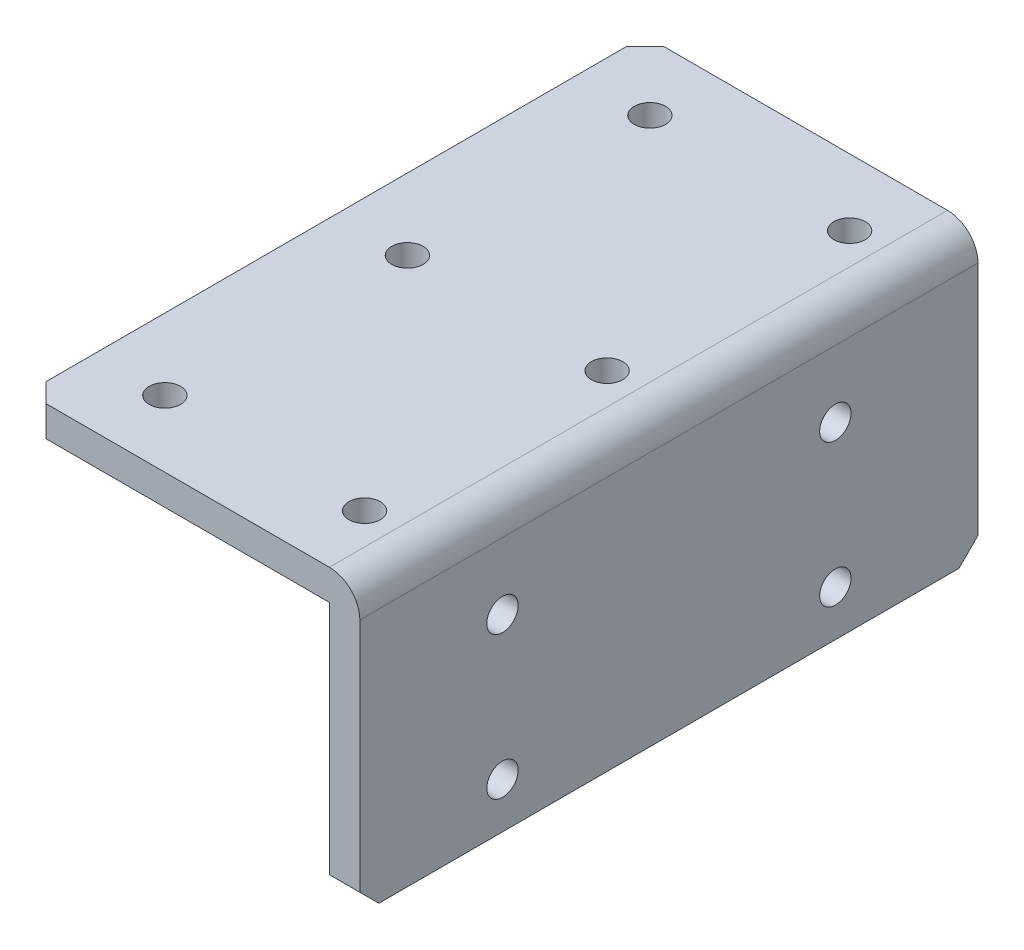
ISO-10303-21;
HEADER;
FILE_DESCRIPTION(('STEP AP214'),'2;1');
FILE_NAME('part.step','',(''),(''),'','','');
FILE_SCHEMA(('AUTOMOTIVE_DESIGN { 1 0 10303 214 1 1 1 1 }'));
ENDSEC;
DATA;
#1=APPLICATION_CONTEXT('core data for automotive mechanical design processes');
#2=APPLICATION_PROTOCOL_DEFINITION('international standard','automotive_design',2000,#1);
#3=PRODUCT_CONTEXT('',#1,'mechanical');
#4=PRODUCT('Part','Part','',(#3));
#5=PRODUCT_RELATED_PRODUCT_CATEGORY('part','',(#4));
#6=PRODUCT_DEFINITION_FORMATION('','',#4);
#7=PRODUCT_DEFINITION_CONTEXT('part definition',#1,'design');
#8=PRODUCT_DEFINITION('design','',#6,#7);
#9=PRODUCT_DEFINITION_SHAPE('','',#8);
#10=(LENGTH_UNIT() NAMED_UNIT(*) SI_UNIT(.MILLI.,.METRE.));
#11=(NAMED_UNIT(*) PLANE_ANGLE_UNIT() SI_UNIT($,.RADIAN.));
#12=(NAMED_UNIT(*) SI_UNIT($,.STERADIAN.) SOLID_ANGLE_UNIT());
#13=UNCERTAINTY_MEASURE_WITH_UNIT(LENGTH_MEASURE(1.E-05),#10,'distance_accuracy_value','');
#14=(GEOMETRIC_REPRESENTATION_CONTEXT(3) GLOBAL_UNCERTAINTY_ASSIGNED_CONTEXT((#13)) GLOBAL_UNIT_ASSIGNED_CONTEXT((#10,
#11,#12)) REPRESENTATION_CONTEXT('',''));
#15=CARTESIAN_POINT('',(0.,0.,0.));
#16=DIRECTION('',(0.,0.,1.));
#17=DIRECTION('',(1.,0.,0.));
#18=AXIS2_PLACEMENT_3D('',#15,#16,#17);
#19=CARTESIAN_POINT('',(0.,-30.,-32.5));
#20=DIRECTION('',(1.,0.,0.));
#21=DIRECTION('',(0.,0.,-1.));
#22=AXIS2_PLACEMENT_3D('',#19,#20,#21);
#23=PLANE('',#22);
#24=CARTESIAN_POINT('',(0.,-10.2,17.5));
#25=DIRECTION('',(1.,0.,0.));
#26=DIRECTION('',(0.,0.,-1.));
#27=AXIS2_PLACEMENT_3D('',#24,#25,#26);
#28=CIRCLE('',#27,1.64999999999999);
#29=CARTESIAN_POINT('',(0.,-10.2,15.85));
#30=VERTEX_POINT('',#29);
#31=EDGE_CURVE('E264',#30,#30,#28,.T.);
#32=ORIENTED_EDGE('',*,*,#31,.F.);
#33=EDGE_LOOP('',(#32));
#34=FACE_BOUND('',#33,.T.);
#35=CARTESIAN_POINT('',(0.,-25.2,17.5));
#36=DIRECTION('',(1.,0.,0.));
#37=DIRECTION('',(0.,0.,-1.));
#38=AXIS2_PLACEMENT_3D('',#35,#36,#37);
#39=CIRCLE('',#38,1.64999999999999);
#40=CARTESIAN_POINT('',(0.,-25.2,15.85));
#41=VERTEX_POINT('',#40);
#42=EDGE_CURVE('E258',#41,#41,#39,.T.);
#43=ORIENTED_EDGE('',*,*,#42,.F.);
#44=EDGE_LOOP('',(#43));
#45=FACE_BOUND('',#44,.T.);
#46=CARTESIAN_POINT('',(0.,-25.2,-17.5));
#47=DIRECTION('',(1.,0.,0.));
#48=DIRECTION('',(0.,0.,-1.));
#49=AXIS2_PLACEMENT_3D('',#46,#47,#48);
#50=CIRCLE('',#49,1.64999999999999);
#51=CARTESIAN_POINT('',(0.,-25.2,-19.15));
#52=VERTEX_POINT('',#51);
#53=EDGE_CURVE('E252',#52,#52,#50,.T.);
#54=ORIENTED_EDGE('',*,*,#53,.F.);
#55=EDGE_LOOP('',(#54));
#56=FACE_BOUND('',#55,.T.);
#57=CARTESIAN_POINT('',(0.,-10.2,-17.5));
#58=DIRECTION('',(1.,0.,0.));
#59=DIRECTION('',(0.,0.,-1.));
#60=AXIS2_PLACEMENT_3D('',#57,#58,#59);
#61=CIRCLE('',#60,1.64999999999999);
#62=CARTESIAN_POINT('',(0.,-10.2,-19.15));
#63=VERTEX_POINT('',#62);
#64=EDGE_CURVE('E244',#63,#63,#61,.T.);
#65=ORIENTED_EDGE('',*,*,#64,.F.);
#66=EDGE_LOOP('',(#65));
#67=FACE_BOUND('',#66,.T.);
#68=DIRECTION('',(0.,0.,1.));
#69=VECTOR('',#68,1.);
#70=CARTESIAN_POINT('',(0.,-30.,-32.5));
#71=LINE('',#70,#69);
#72=CARTESIAN_POINT('',(0.,-30.,-30.5));
#73=VERTEX_POINT('',#72);
#74=CARTESIAN_POINT('',(0.,-30.,30.5));
#75=VERTEX_POINT('',#74);
#76=EDGE_CURVE('E156',#73,#75,#71,.T.);
#77=ORIENTED_EDGE('',*,*,#76,.F.);
#78=DIRECTION('',(0.,0.707106781186549,-0.707106781186546));
#79=VECTOR('',#78,1.);
#80=CARTESIAN_POINT('',(0.,-29.,-31.5));
#81=LINE('',#80,#79);
#82=CARTESIAN_POINT('',(0.,-28.,-32.5));
#83=VERTEX_POINT('',#82);
#84=EDGE_CURVE('E223',#73,#83,#81,.T.);
#85=ORIENTED_EDGE('',*,*,#84,.T.);
#86=DIRECTION('',(0.,1.,0.));
#87=VECTOR('',#86,1.);
#88=CARTESIAN_POINT('',(0.,-30.,-32.5));
#89=LINE('',#88,#87);
#90=CARTESIAN_POINT('',(0.,-3.2,-32.5));
#91=VERTEX_POINT('',#90);
#92=EDGE_CURVE('E144',#83,#91,#89,.T.);
#93=ORIENTED_EDGE('',*,*,#92,.T.);
#94=DIRECTION('',(0.,0.,1.));
#95=VECTOR('',#94,1.);
#96=CARTESIAN_POINT('',(0.,-3.2,-32.5));
#97=LINE('',#96,#95);
#98=CARTESIAN_POINT('',(0.,-3.2,32.5));
#99=VERTEX_POINT('',#98);
#100=EDGE_CURVE('E158',#91,#99,#97,.T.);
#101=ORIENTED_EDGE('',*,*,#100,.T.);
#102=DIRECTION('',(0.,1.,0.));
#103=VECTOR('',#102,1.);
#104=CARTESIAN_POINT('',(0.,-30.,32.5));
#105=LINE('',#104,#103);
#106=CARTESIAN_POINT('',(0.,-28.,32.5));
#107=VERTEX_POINT('',#106);
#108=EDGE_CURVE('E239',#107,#99,#105,.T.);
#109=ORIENTED_EDGE('',*,*,#108,.F.);
#110=DIRECTION('',(0.,0.707106781186546,0.707106781186549));
#111=VECTOR('',#110,1.);
#112=CARTESIAN_POINT('',(0.,-61.5,-1.00000000000012));
#113=LINE('',#112,#111);
#114=EDGE_CURVE('E221',#107,#75,#113,.F.);
#115=ORIENTED_EDGE('',*,*,#114,.T.);
#116=EDGE_LOOP('',(#77,#85,#93,#101,#109,#115));
#117=FACE_BOUND('',#116,.T.);
#118=ADVANCED_FACE('F34',(#34,#45,#56,#67,#117),#23,.T.);
#119=CARTESIAN_POINT('',(0.,-30.,-32.5));
#120=DIRECTION('',(0.,-1.,0.));
#121=DIRECTION('',(0.,0.,-1.));
#122=AXIS2_PLACEMENT_3D('',#119,#120,#121);
#123=PLANE('',#122);
#124=DIRECTION('',(0.,0.,1.));
#125=VECTOR('',#124,1.);
#126=CARTESIAN_POINT('',(-3.2,-30.,-32.5));
#127=LINE('',#126,#125);
#128=CARTESIAN_POINT('',(-3.2,-30.,-30.5));
#129=VERTEX_POINT('',#128);
#130=CARTESIAN_POINT('',(-3.2,-30.,30.5));
#131=VERTEX_POINT('',#130);
#132=EDGE_CURVE('E139',#129,#131,#127,.T.);
#133=ORIENTED_EDGE('',*,*,#132,.F.);
#134=DIRECTION('',(1.,0.,0.));
#135=VECTOR('',#134,1.);
#136=CARTESIAN_POINT('',(0.,-30.,-30.5));
#137=LINE('',#136,#135);
#138=EDGE_CURVE('E218',#129,#73,#137,.T.);
#139=ORIENTED_EDGE('',*,*,#138,.T.);
#140=ORIENTED_EDGE('',*,*,#76,.T.);
#141=DIRECTION('',(-1.,0.,0.));
#142=VECTOR('',#141,1.);
#143=CARTESIAN_POINT('',(0.,-30.,30.5));
#144=LINE('',#143,#142);
#145=EDGE_CURVE('E49',#75,#131,#144,.T.);
#146=ORIENTED_EDGE('',*,*,#145,.T.);
#147=EDGE_LOOP('',(#133,#139,#140,#146));
#148=FACE_BOUND('',#147,.T.);
#149=ADVANCED_FACE('F236',(#148),#123,.T.);
#150=CARTESIAN_POINT('',(-3.2,-30.,-32.5));
#151=DIRECTION('',(-1.,0.,0.));
#152=DIRECTION('',(0.,0.,1.));
#153=AXIS2_PLACEMENT_3D('',#150,#151,#152);
#154=PLANE('',#153);
#155=CARTESIAN_POINT('',(-3.2,-10.2,17.5));
#156=DIRECTION('',(-1.,0.,0.));
#157=DIRECTION('',(0.,0.,1.));
#158=AXIS2_PLACEMENT_3D('',#155,#156,#157);
#159=CIRCLE('',#158,1.64999999999999);
#160=CARTESIAN_POINT('',(-3.2,-10.2,19.15));
#161=VERTEX_POINT('',#160);
#162=EDGE_CURVE('E261',#161,#161,#159,.T.);
#163=ORIENTED_EDGE('',*,*,#162,.F.);
#164=EDGE_LOOP('',(#163));
#165=FACE_BOUND('',#164,.T.);
#166=CARTESIAN_POINT('',(-3.2,-25.2,17.5));
#167=DIRECTION('',(-1.,0.,0.));
#168=DIRECTION('',(0.,0.,1.));
#169=AXIS2_PLACEMENT_3D('',#166,#167,#168);
#170=CIRCLE('',#169,1.64999999999999);
#171=CARTESIAN_POINT('',(-3.2,-25.2,19.15));
#172=VERTEX_POINT('',#171);
#173=EDGE_CURVE('E255',#172,#172,#170,.T.);
#174=ORIENTED_EDGE('',*,*,#173,.F.);
#175=EDGE_LOOP('',(#174));
#176=FACE_BOUND('',#175,.T.);
#177=CARTESIAN_POINT('',(-3.2,-25.2,-17.5));
#178=DIRECTION('',(-1.,0.,0.));
#179=DIRECTION('',(0.,0.,1.));
#180=AXIS2_PLACEMENT_3D('',#177,#178,#179);
#181=CIRCLE('',#180,1.64999999999999);
#182=CARTESIAN_POINT('',(-3.2,-25.2,-15.85));
#183=VERTEX_POINT('',#182);
#184=EDGE_CURVE('E249',#183,#183,#181,.T.);
#185=ORIENTED_EDGE('',*,*,#184,.F.);
#186=EDGE_LOOP('',(#185));
#187=FACE_BOUND('',#186,.T.);
#188=CARTESIAN_POINT('',(-3.2,-10.2,-17.5));
#189=DIRECTION('',(-1.,0.,0.));
#190=DIRECTION('',(0.,0.,1.));
#191=AXIS2_PLACEMENT_3D('',#188,#189,#190);
#192=CIRCLE('',#191,1.64999999999999);
#193=CARTESIAN_POINT('',(-3.2,-10.2,-15.85));
#194=VERTEX_POINT('',#193);
#195=EDGE_CURVE('E241',#194,#194,#192,.T.);
#196=ORIENTED_EDGE('',*,*,#195,.F.);
#197=EDGE_LOOP('',(#196));
#198=FACE_BOUND('',#197,.T.);
#199=DIRECTION('',(0.,-1.,0.));
#200=VECTOR('',#199,1.);
#201=CARTESIAN_POINT('',(-3.2,-30.,-32.5));
#202=LINE('',#201,#200);
#203=CARTESIAN_POINT('',(-3.2,-3.2,-32.5));
#204=VERTEX_POINT('',#203);
#205=CARTESIAN_POINT('',(-3.2,-28.,-32.5));
#206=VERTEX_POINT('',#205);
#207=EDGE_CURVE('E153',#204,#206,#202,.T.);
#208=ORIENTED_EDGE('',*,*,#207,.T.);
#209=DIRECTION('',(0.,-0.707106781186549,0.707106781186546));
#210=VECTOR('',#209,1.);
#211=CARTESIAN_POINT('',(-3.2,-29.,-31.5));
#212=LINE('',#211,#210);
#213=EDGE_CURVE('E11',#206,#129,#212,.T.);
#214=ORIENTED_EDGE('',*,*,#213,.T.);
#215=ORIENTED_EDGE('',*,*,#132,.T.);
#216=DIRECTION('',(0.,-0.707106781186546,-0.707106781186549));
#217=VECTOR('',#216,1.);
#218=CARTESIAN_POINT('',(-3.2,-61.5,-1.00000000000012));
#219=LINE('',#218,#217);
#220=CARTESIAN_POINT('',(-3.2,-28.,32.5));
#221=VERTEX_POINT('',#220);
#222=EDGE_CURVE('E42',#131,#221,#219,.F.);
#223=ORIENTED_EDGE('',*,*,#222,.T.);
#224=DIRECTION('',(0.,-1.,0.));
#225=VECTOR('',#224,1.);
#226=CARTESIAN_POINT('',(-3.2,-30.,32.5));
#227=LINE('',#226,#225);
#228=CARTESIAN_POINT('',(-3.2,-3.2,32.5));
#229=VERTEX_POINT('',#228);
#230=EDGE_CURVE('E124',#229,#221,#227,.T.);
#231=ORIENTED_EDGE('',*,*,#230,.F.);
#232=DIRECTION('',(0.,0.,1.));
#233=VECTOR('',#232,1.);
#234=CARTESIAN_POINT('',(-3.2,-3.2,-32.5));
#235=LINE('',#234,#233);
#236=EDGE_CURVE('E132',#204,#229,#235,.T.);
#237=ORIENTED_EDGE('',*,*,#236,.F.);
#238=EDGE_LOOP('',(#208,#214,#215,#223,#231,#237));
#239=FACE_BOUND('',#238,.T.);
#240=ADVANCED_FACE('F142',(#165,#176,#187,#198,#239),#154,.T.);
#241=CARTESIAN_POINT('',(-3.2,-3.2,-32.5));
#242=DIRECTION('',(0.,-1.,0.));
#243=DIRECTION('',(1.,0.,0.));
#244=AXIS2_PLACEMENT_3D('',#241,#242,#243);
#245=PLANE('',#244);
#246=CARTESIAN_POINT('',(-27.5,-3.2,25.5));
#247=DIRECTION('',(0.,-1.,0.));
#248=DIRECTION('',(1.,0.,0.));
#249=AXIS2_PLACEMENT_3D('',#246,#247,#248);
#250=CIRCLE('',#249,1.64999999999999);
#251=CARTESIAN_POINT('',(-25.85,-3.2,25.5));
#252=VERTEX_POINT('',#251);
#253=EDGE_CURVE('E273',#252,#252,#250,.T.);
#254=ORIENTED_EDGE('',*,*,#253,.F.);
#255=EDGE_LOOP('',(#254));
#256=FACE_BOUND('',#255,.T.);
#257=CARTESIAN_POINT('',(-6.5,-3.2,25.5));
#258=DIRECTION('',(0.,-1.,0.));
#259=DIRECTION('',(1.,0.,0.));
#260=AXIS2_PLACEMENT_3D('',#257,#258,#259);
#261=CIRCLE('',#260,1.64999999999999);
#262=CARTESIAN_POINT('',(-4.85,-3.2,25.5));
#263=VERTEX_POINT('',#262);
#264=EDGE_CURVE('E267',#263,#263,#261,.T.);
#265=ORIENTED_EDGE('',*,*,#264,.F.);
#266=EDGE_LOOP('',(#265));
#267=FACE_BOUND('',#266,.T.);
#268=DIRECTION('',(0.,0.,1.));
#269=VECTOR('',#268,1.);
#270=CARTESIAN_POINT('',(-35.,-3.20000000000001,-32.5));
#271=LINE('',#270,#269);
#272=CARTESIAN_POINT('',(-35.,-3.20000000000001,-30.5));
#273=VERTEX_POINT('',#272);
#274=CARTESIAN_POINT('',(-35.,-3.20000000000001,30.5));
#275=VERTEX_POINT('',#274);
#276=EDGE_CURVE('E140',#273,#275,#271,.T.);
#277=ORIENTED_EDGE('',*,*,#276,.F.);
#278=DIRECTION('',(0.707106781186549,0.,-0.707106781186546));
#279=VECTOR('',#278,1.);
#280=CARTESIAN_POINT('',(-18.0999999999999,-3.2,-47.4));
#281=LINE('',#280,#279);
#282=CARTESIAN_POINT('',(-33.,-3.2,-32.5));
#283=VERTEX_POINT('',#282);
#284=EDGE_CURVE('E204',#273,#283,#281,.T.);
#285=ORIENTED_EDGE('',*,*,#284,.T.);
#286=DIRECTION('',(1.,0.,0.));
#287=VECTOR('',#286,1.);
#288=CARTESIAN_POINT('',(-3.2,-3.2,-32.5));
#289=LINE('',#288,#287);
#290=EDGE_CURVE('E137',#283,#204,#289,.T.);
#291=ORIENTED_EDGE('',*,*,#290,.T.);
#292=ORIENTED_EDGE('',*,*,#236,.T.);
#293=DIRECTION('',(1.,0.,0.));
#294=VECTOR('',#293,1.);
#295=CARTESIAN_POINT('',(-3.2,-3.2,32.5));
#296=LINE('',#295,#294);
#297=CARTESIAN_POINT('',(-33.,-3.20000000000001,32.5));
#298=VERTEX_POINT('',#297);
#299=EDGE_CURVE('E118',#298,#229,#296,.T.);
#300=ORIENTED_EDGE('',*,*,#299,.F.);
#301=DIRECTION('',(0.707106781186546,0.,0.707106781186549));
#302=VECTOR('',#301,1.);
#303=CARTESIAN_POINT('',(-50.6000000000001,-3.20000000000001,14.8999999999999));
#304=LINE('',#303,#302);
#305=EDGE_CURVE('E202',#298,#275,#304,.F.);
#306=ORIENTED_EDGE('',*,*,#305,.T.);
#307=EDGE_LOOP('',(#277,#285,#291,#292,#300,#306));
#308=FACE_BOUND('',#307,.T.);
#309=CARTESIAN_POINT('',(-6.5,-3.2,0.));
#310=DIRECTION('',(0.,-1.,0.));
#311=DIRECTION('',(1.,0.,0.));
#312=AXIS2_PLACEMENT_3D('',#309,#310,#311);
#313=CIRCLE('',#312,1.64999999999999);
#314=CARTESIAN_POINT('',(-4.85,-3.2,0.));
#315=VERTEX_POINT('',#314);
#316=EDGE_CURVE('E176',#315,#315,#313,.T.);
#317=ORIENTED_EDGE('',*,*,#316,.F.);
#318=EDGE_LOOP('',(#317));
#319=FACE_BOUND('',#318,.T.);
#320=CARTESIAN_POINT('',(-27.5,-3.2,0.));
#321=DIRECTION('',(0.,-1.,0.));
#322=DIRECTION('',(1.,0.,0.));
#323=AXIS2_PLACEMENT_3D('',#320,#321,#322);
#324=CIRCLE('',#323,1.64999999999999);
#325=CARTESIAN_POINT('',(-25.85,-3.2,0.));
#326=VERTEX_POINT('',#325);
#327=EDGE_CURVE('E182',#326,#326,#324,.T.);
#328=ORIENTED_EDGE('',*,*,#327,.F.);
#329=EDGE_LOOP('',(#328));
#330=FACE_BOUND('',#329,.T.);
#331=CARTESIAN_POINT('',(-6.5,-3.2,-25.5));
#332=DIRECTION('',(0.,-1.,0.));
#333=DIRECTION('',(1.,0.,0.));
#334=AXIS2_PLACEMENT_3D('',#331,#332,#333);
#335=CIRCLE('',#334,1.64999999999999);
#336=CARTESIAN_POINT('',(-4.85,-3.2,-25.5));
#337=VERTEX_POINT('',#336);
#338=EDGE_CURVE('E188',#337,#337,#335,.T.);
#339=ORIENTED_EDGE('',*,*,#338,.F.);
#340=EDGE_LOOP('',(#339));
#341=FACE_BOUND('',#340,.T.);
#342=CARTESIAN_POINT('',(-27.5,-3.2,-25.5));
#343=DIRECTION('',(0.,-1.,0.));
#344=DIRECTION('',(1.,0.,0.));
#345=AXIS2_PLACEMENT_3D('',#342,#343,#344);
#346=CIRCLE('',#345,1.64999999999999);
#347=CARTESIAN_POINT('',(-25.85,-3.2,-25.5));
#348=VERTEX_POINT('',#347);
#349=EDGE_CURVE('E194',#348,#348,#346,.T.);
#350=ORIENTED_EDGE('',*,*,#349,.F.);
#351=EDGE_LOOP('',(#350));
#352=FACE_BOUND('',#351,.T.);
#353=ADVANCED_FACE('F134',(#256,#267,#308,#319,#330,#341,#352),#245,.T.);
#354=CARTESIAN_POINT('',(-35.,0.,-32.5));
#355=DIRECTION('',(-1.,0.,0.));
#356=DIRECTION('',(0.,0.,1.));
#357=AXIS2_PLACEMENT_3D('',#354,#355,#356);
#358=PLANE('',#357);
#359=DIRECTION('',(0.,0.,1.));
#360=VECTOR('',#359,1.);
#361=CARTESIAN_POINT('',(-35.,0.,-32.5));
#362=LINE('',#361,#360);
#363=CARTESIAN_POINT('',(-35.,0.,-30.5));
#364=VERTEX_POINT('',#363);
#365=CARTESIAN_POINT('',(-35.,0.,30.5));
#366=VERTEX_POINT('',#365);
#367=EDGE_CURVE('E155',#364,#366,#362,.T.);
#368=ORIENTED_EDGE('',*,*,#367,.F.);
#369=DIRECTION('',(0.,-1.,0.));
#370=VECTOR('',#369,1.);
#371=CARTESIAN_POINT('',(-35.,-3.20000000000001,-30.5));
#372=LINE('',#371,#370);
#373=EDGE_CURVE('E199',#364,#273,#372,.T.);
#374=ORIENTED_EDGE('',*,*,#373,.T.);
#375=ORIENTED_EDGE('',*,*,#276,.T.);
#376=DIRECTION('',(0.,1.,0.));
#377=VECTOR('',#376,1.);
#378=CARTESIAN_POINT('',(-35.,0.,30.5));
#379=LINE('',#378,#377);
#380=EDGE_CURVE('E197',#275,#366,#379,.T.);
#381=ORIENTED_EDGE('',*,*,#380,.T.);
#382=EDGE_LOOP('',(#368,#374,#375,#381));
#383=FACE_BOUND('',#382,.T.);
#384=ADVANCED_FACE('F286',(#383),#358,.T.);
#385=CARTESIAN_POINT('',(0.,0.,-32.5));
#386=DIRECTION('',(0.,1.,0.));
#387=DIRECTION('',(-1.,0.,0.));
#388=AXIS2_PLACEMENT_3D('',#385,#386,#387);
#389=PLANE('',#388);
#390=CARTESIAN_POINT('',(-27.5,0.,25.5));
#391=DIRECTION('',(0.,1.,0.));
#392=DIRECTION('',(0.,0.,1.));
#393=AXIS2_PLACEMENT_3D('',#390,#391,#392);
#394=CIRCLE('',#393,1.64999999999999);
#395=CARTESIAN_POINT('',(-27.5,0.,27.15));
#396=VERTEX_POINT('',#395);
#397=EDGE_CURVE('E276',#396,#396,#394,.T.);
#398=ORIENTED_EDGE('',*,*,#397,.F.);
#399=EDGE_LOOP('',(#398));
#400=FACE_BOUND('',#399,.T.);
#401=CARTESIAN_POINT('',(-6.5,0.,25.5));
#402=DIRECTION('',(0.,1.,0.));
#403=DIRECTION('',(0.,0.,1.));
#404=AXIS2_PLACEMENT_3D('',#401,#402,#403);
#405=CIRCLE('',#404,1.64999999999999);
#406=CARTESIAN_POINT('',(-6.5,0.,27.15));
#407=VERTEX_POINT('',#406);
#408=EDGE_CURVE('E270',#407,#407,#405,.T.);
#409=ORIENTED_EDGE('',*,*,#408,.F.);
#410=EDGE_LOOP('',(#409));
#411=FACE_BOUND('',#410,.T.);
#412=DIRECTION('',(-1.,0.,0.));
#413=VECTOR('',#412,1.);
#414=CARTESIAN_POINT('',(0.,0.,-32.5));
#415=LINE('',#414,#413);
#416=CARTESIAN_POINT('',(-3.2,0.,-32.5));
#417=VERTEX_POINT('',#416);
#418=CARTESIAN_POINT('',(-33.,0.,-32.5));
#419=VERTEX_POINT('',#418);
#420=EDGE_CURVE('E146',#417,#419,#415,.T.);
#421=ORIENTED_EDGE('',*,*,#420,.T.);
#422=DIRECTION('',(-0.707106781186549,0.,0.707106781186546));
#423=VECTOR('',#422,1.);
#424=CARTESIAN_POINT('',(-16.4999999999999,0.,-49.));
#425=LINE('',#424,#423);
#426=EDGE_CURVE('E212',#419,#364,#425,.T.);
#427=ORIENTED_EDGE('',*,*,#426,.T.);
#428=ORIENTED_EDGE('',*,*,#367,.T.);
#429=DIRECTION('',(-0.707106781186546,0.,-0.707106781186549));
#430=VECTOR('',#429,1.);
#431=CARTESIAN_POINT('',(-49.0000000000001,0.,16.4999999999999));
#432=LINE('',#431,#430);
#433=CARTESIAN_POINT('',(-33.,0.,32.5));
#434=VERTEX_POINT('',#433);
#435=EDGE_CURVE('E210',#366,#434,#432,.F.);
#436=ORIENTED_EDGE('',*,*,#435,.T.);
#437=DIRECTION('',(-1.,0.,0.));
#438=VECTOR('',#437,1.);
#439=CARTESIAN_POINT('',(0.,0.,32.5));
#440=LINE('',#439,#438);
#441=CARTESIAN_POINT('',(-3.2,0.,32.5));
#442=VERTEX_POINT('',#441);
#443=EDGE_CURVE('E129',#442,#434,#440,.T.);
#444=ORIENTED_EDGE('',*,*,#443,.F.);
#445=DIRECTION('',(0.,0.,1.));
#446=VECTOR('',#445,1.);
#447=CARTESIAN_POINT('',(-3.2,0.,-32.5));
#448=LINE('',#447,#446);
#449=EDGE_CURVE('E168',#442,#417,#448,.F.);
#450=ORIENTED_EDGE('',*,*,#449,.T.);
#451=EDGE_LOOP('',(#421,#427,#428,#436,#444,#450));
#452=FACE_BOUND('',#451,.T.);
#453=CARTESIAN_POINT('',(-6.5,0.,0.));
#454=DIRECTION('',(0.,1.,0.));
#455=DIRECTION('',(0.,0.,1.));
#456=AXIS2_PLACEMENT_3D('',#453,#454,#455);
#457=CIRCLE('',#456,1.64999999999999);
#458=CARTESIAN_POINT('',(-6.5,0.,1.64999999999999));
#459=VERTEX_POINT('',#458);
#460=EDGE_CURVE('E173',#459,#459,#457,.T.);
#461=ORIENTED_EDGE('',*,*,#460,.F.);
#462=EDGE_LOOP('',(#461));
#463=FACE_BOUND('',#462,.T.);
#464=CARTESIAN_POINT('',(-27.5,0.,0.));
#465=DIRECTION('',(0.,1.,0.));
#466=DIRECTION('',(0.,0.,1.));
#467=AXIS2_PLACEMENT_3D('',#464,#465,#466);
#468=CIRCLE('',#467,1.64999999999999);
#469=CARTESIAN_POINT('',(-27.5,0.,1.64999999999999));
#470=VERTEX_POINT('',#469);
#471=EDGE_CURVE('E179',#470,#470,#468,.T.);
#472=ORIENTED_EDGE('',*,*,#471,.F.);
#473=EDGE_LOOP('',(#472));
#474=FACE_BOUND('',#473,.T.);
#475=CARTESIAN_POINT('',(-6.5,0.,-25.5));
#476=DIRECTION('',(0.,1.,0.));
#477=DIRECTION('',(0.,0.,1.));
#478=AXIS2_PLACEMENT_3D('',#475,#476,#477);
#479=CIRCLE('',#478,1.64999999999999);
#480=CARTESIAN_POINT('',(-6.5,0.,-23.85));
#481=VERTEX_POINT('',#480);
#482=EDGE_CURVE('E185',#481,#481,#479,.T.);
#483=ORIENTED_EDGE('',*,*,#482,.F.);
#484=EDGE_LOOP('',(#483));
#485=FACE_BOUND('',#484,.T.);
#486=CARTESIAN_POINT('',(-27.5,0.,-25.5));
#487=DIRECTION('',(0.,1.,0.));
#488=DIRECTION('',(0.,0.,1.));
#489=AXIS2_PLACEMENT_3D('',#486,#487,#488);
#490=CIRCLE('',#489,1.64999999999999);
#491=CARTESIAN_POINT('',(-27.5,0.,-23.85));
#492=VERTEX_POINT('',#491);
#493=EDGE_CURVE('E191',#492,#492,#490,.T.);
#494=ORIENTED_EDGE('',*,*,#493,.F.);
#495=EDGE_LOOP('',(#494));
#496=FACE_BOUND('',#495,.T.);
#497=ADVANCED_FACE('F283',(#400,#411,#452,#463,#474,#485,#496),#389,.T.);
#498=CARTESIAN_POINT('',(0.,0.,-32.5));
#499=DIRECTION('',(0.,0.,1.));
#500=DIRECTION('',(1.,0.,0.));
#501=AXIS2_PLACEMENT_3D('',#498,#499,#500);
#502=PLANE('',#501);
#503=ORIENTED_EDGE('',*,*,#290,.F.);
#504=DIRECTION('',(0.,1.,0.));
#505=VECTOR('',#504,1.);
#506=CARTESIAN_POINT('',(-33.,0.,-32.5));
#507=LINE('',#506,#505);
#508=EDGE_CURVE('E208',#283,#419,#507,.T.);
#509=ORIENTED_EDGE('',*,*,#508,.T.);
#510=ORIENTED_EDGE('',*,*,#420,.F.);
#511=CARTESIAN_POINT('',(-3.2,-3.2,-32.5));
#512=DIRECTION('',(0.,0.,1.));
#513=DIRECTION('',(1.,0.,0.));
#514=AXIS2_PLACEMENT_3D('',#511,#512,#513);
#515=CIRCLE('',#514,3.2);
#516=EDGE_CURVE('E170',#417,#91,#515,.F.);
#517=ORIENTED_EDGE('',*,*,#516,.T.);
#518=ORIENTED_EDGE('',*,*,#92,.F.);
#519=DIRECTION('',(-1.,0.,0.));
#520=VECTOR('',#519,1.);
#521=CARTESIAN_POINT('',(-3.2,-28.,-32.5));
#522=LINE('',#521,#520);
#523=EDGE_CURVE('E206',#83,#206,#522,.T.);
#524=ORIENTED_EDGE('',*,*,#523,.T.);
#525=ORIENTED_EDGE('',*,*,#207,.F.);
#526=EDGE_LOOP('',(#503,#509,#510,#517,#518,#524,#525));
#527=FACE_BOUND('',#526,.T.);
#528=ADVANCED_FACE('F231',(#527),#502,.F.);
#529=CARTESIAN_POINT('',(0.,0.,32.5));
#530=DIRECTION('',(0.,0.,1.));
#531=DIRECTION('',(1.,0.,0.));
#532=AXIS2_PLACEMENT_3D('',#529,#530,#531);
#533=PLANE('',#532);
#534=ORIENTED_EDGE('',*,*,#443,.T.);
#535=DIRECTION('',(0.,-1.,0.));
#536=VECTOR('',#535,1.);
#537=CARTESIAN_POINT('',(-33.,0.,32.5));
#538=LINE('',#537,#536);
#539=EDGE_CURVE('E127',#434,#298,#538,.T.);
#540=ORIENTED_EDGE('',*,*,#539,.T.);
#541=ORIENTED_EDGE('',*,*,#299,.T.);
#542=ORIENTED_EDGE('',*,*,#230,.T.);
#543=DIRECTION('',(1.,0.,0.));
#544=VECTOR('',#543,1.);
#545=CARTESIAN_POINT('',(0.,-28.,32.5));
#546=LINE('',#545,#544);
#547=EDGE_CURVE('E214',#221,#107,#546,.T.);
#548=ORIENTED_EDGE('',*,*,#547,.T.);
#549=ORIENTED_EDGE('',*,*,#108,.T.);
#550=CARTESIAN_POINT('',(-3.2,-3.2,32.5));
#551=DIRECTION('',(0.,0.,1.));
#552=DIRECTION('',(1.,0.,0.));
#553=AXIS2_PLACEMENT_3D('',#550,#551,#552);
#554=CIRCLE('',#553,3.2);
#555=EDGE_CURVE('E166',#99,#442,#554,.T.);
#556=ORIENTED_EDGE('',*,*,#555,.T.);
#557=EDGE_LOOP('',(#534,#540,#541,#542,#548,#549,#556));
#558=FACE_BOUND('',#557,.T.);
#559=ADVANCED_FACE('F121',(#558),#533,.T.);
#560=CARTESIAN_POINT('',(-3.2,-3.2,-32.5));
#561=DIRECTION('',(0.,0.,1.));
#562=DIRECTION('',(1.,0.,0.));
#563=AXIS2_PLACEMENT_3D('',#560,#561,#562);
#564=CYLINDRICAL_SURFACE('',#563,3.2);
#565=ORIENTED_EDGE('',*,*,#516,.F.);
#566=ORIENTED_EDGE('',*,*,#449,.F.);
#567=ORIENTED_EDGE('',*,*,#555,.F.);
#568=ORIENTED_EDGE('',*,*,#100,.F.);
#569=EDGE_LOOP('',(#565,#566,#567,#568));
#570=FACE_BOUND('',#569,.T.);
#571=ADVANCED_FACE('F331',(#570),#564,.T.);
#572=CARTESIAN_POINT('',(0.,-10.2,-17.5));
#573=DIRECTION('',(1.,0.,0.));
#574=DIRECTION('',(0.,0.,-1.));
#575=AXIS2_PLACEMENT_3D('',#572,#573,#574);
#576=CYLINDRICAL_SURFACE('',#575,1.64999999999999);
#577=ORIENTED_EDGE('',*,*,#64,.T.);
#578=EDGE_LOOP('',(#577));
#579=FACE_BOUND('',#578,.T.);
#580=ORIENTED_EDGE('',*,*,#195,.T.);
#581=EDGE_LOOP('',(#580));
#582=FACE_BOUND('',#581,.T.);
#583=ADVANCED_FACE('F334',(#579,#582),#576,.F.);
#584=CARTESIAN_POINT('',(0.,-25.2,-17.5));
#585=DIRECTION('',(1.,0.,0.));
#586=DIRECTION('',(0.,0.,-1.));
#587=AXIS2_PLACEMENT_3D('',#584,#585,#586);
#588=CYLINDRICAL_SURFACE('',#587,1.64999999999999);
#589=ORIENTED_EDGE('',*,*,#53,.T.);
#590=EDGE_LOOP('',(#589));
#591=FACE_BOUND('',#590,.T.);
#592=ORIENTED_EDGE('',*,*,#184,.T.);
#593=EDGE_LOOP('',(#592));
#594=FACE_BOUND('',#593,.T.);
#595=ADVANCED_FACE('F495',(#591,#594),#588,.F.);
#596=CARTESIAN_POINT('',(0.,-25.2,17.5));
#597=DIRECTION('',(1.,0.,0.));
#598=DIRECTION('',(0.,0.,-1.));
#599=AXIS2_PLACEMENT_3D('',#596,#597,#598);
#600=CYLINDRICAL_SURFACE('',#599,1.64999999999999);
#601=ORIENTED_EDGE('',*,*,#42,.T.);
#602=EDGE_LOOP('',(#601));
#603=FACE_BOUND('',#602,.T.);
#604=ORIENTED_EDGE('',*,*,#173,.T.);
#605=EDGE_LOOP('',(#604));
#606=FACE_BOUND('',#605,.T.);
#607=ADVANCED_FACE('F484',(#603,#606),#600,.F.);
#608=CARTESIAN_POINT('',(0.,-10.2,17.5));
#609=DIRECTION('',(1.,0.,0.));
#610=DIRECTION('',(0.,0.,-1.));
#611=AXIS2_PLACEMENT_3D('',#608,#609,#610);
#612=CYLINDRICAL_SURFACE('',#611,1.64999999999999);
#613=ORIENTED_EDGE('',*,*,#31,.T.);
#614=EDGE_LOOP('',(#613));
#615=FACE_BOUND('',#614,.T.);
#616=ORIENTED_EDGE('',*,*,#162,.T.);
#617=EDGE_LOOP('',(#616));
#618=FACE_BOUND('',#617,.T.);
#619=ADVANCED_FACE('F473',(#615,#618),#612,.F.);
#620=CARTESIAN_POINT('',(-6.5,0.,25.5));
#621=DIRECTION('',(0.,1.,0.));
#622=DIRECTION('',(0.,0.,1.));
#623=AXIS2_PLACEMENT_3D('',#620,#621,#622);
#624=CYLINDRICAL_SURFACE('',#623,1.64999999999999);
#625=ORIENTED_EDGE('',*,*,#408,.T.);
#626=EDGE_LOOP('',(#625));
#627=FACE_BOUND('',#626,.T.);
#628=ORIENTED_EDGE('',*,*,#264,.T.);
#629=EDGE_LOOP('',(#628));
#630=FACE_BOUND('',#629,.T.);
#631=ADVANCED_FACE('F462',(#627,#630),#624,.F.);
#632=CARTESIAN_POINT('',(-27.5,0.,25.5));
#633=DIRECTION('',(0.,1.,0.));
#634=DIRECTION('',(0.,0.,1.));
#635=AXIS2_PLACEMENT_3D('',#632,#633,#634);
#636=CYLINDRICAL_SURFACE('',#635,1.64999999999999);
#637=ORIENTED_EDGE('',*,*,#397,.T.);
#638=EDGE_LOOP('',(#637));
#639=FACE_BOUND('',#638,.T.);
#640=ORIENTED_EDGE('',*,*,#253,.T.);
#641=EDGE_LOOP('',(#640));
#642=FACE_BOUND('',#641,.T.);
#643=ADVANCED_FACE('F280',(#639,#642),#636,.F.);
#644=CARTESIAN_POINT('',(-6.5,0.,0.));
#645=DIRECTION('',(0.,1.,0.));
#646=DIRECTION('',(0.,0.,1.));
#647=AXIS2_PLACEMENT_3D('',#644,#645,#646);
#648=CYLINDRICAL_SURFACE('',#647,1.64999999999999);
#649=ORIENTED_EDGE('',*,*,#460,.T.);
#650=EDGE_LOOP('',(#649));
#651=FACE_BOUND('',#650,.T.);
#652=ORIENTED_EDGE('',*,*,#316,.T.);
#653=EDGE_LOOP('',(#652));
#654=FACE_BOUND('',#653,.T.);
#655=ADVANCED_FACE('F336',(#651,#654),#648,.F.);
#656=CARTESIAN_POINT('',(-27.5,0.,0.));
#657=DIRECTION('',(0.,1.,0.));
#658=DIRECTION('',(0.,0.,1.));
#659=AXIS2_PLACEMENT_3D('',#656,#657,#658);
#660=CYLINDRICAL_SURFACE('',#659,1.64999999999999);
#661=ORIENTED_EDGE('',*,*,#471,.T.);
#662=EDGE_LOOP('',(#661));
#663=FACE_BOUND('',#662,.T.);
#664=ORIENTED_EDGE('',*,*,#327,.T.);
#665=EDGE_LOOP('',(#664));
#666=FACE_BOUND('',#665,.T.);
#667=ADVANCED_FACE('F339',(#663,#666),#660,.F.);
#668=CARTESIAN_POINT('',(-6.5,0.,-25.5));
#669=DIRECTION('',(0.,1.,0.));
#670=DIRECTION('',(0.,0.,1.));
#671=AXIS2_PLACEMENT_3D('',#668,#669,#670);
#672=CYLINDRICAL_SURFACE('',#671,1.64999999999999);
#673=ORIENTED_EDGE('',*,*,#482,.T.);
#674=EDGE_LOOP('',(#673));
#675=FACE_BOUND('',#674,.T.);
#676=ORIENTED_EDGE('',*,*,#338,.T.);
#677=EDGE_LOOP('',(#676));
#678=FACE_BOUND('',#677,.T.);
#679=ADVANCED_FACE('F304',(#675,#678),#672,.F.);
#680=CARTESIAN_POINT('',(-27.5,0.,-25.5));
#681=DIRECTION('',(0.,1.,0.));
#682=DIRECTION('',(0.,0.,1.));
#683=AXIS2_PLACEMENT_3D('',#680,#681,#682);
#684=CYLINDRICAL_SURFACE('',#683,1.64999999999999);
#685=ORIENTED_EDGE('',*,*,#493,.T.);
#686=EDGE_LOOP('',(#685));
#687=FACE_BOUND('',#686,.T.);
#688=ORIENTED_EDGE('',*,*,#349,.T.);
#689=EDGE_LOOP('',(#688));
#690=FACE_BOUND('',#689,.T.);
#691=ADVANCED_FACE('F300',(#687,#690),#684,.F.);
#692=CARTESIAN_POINT('',(-35.,0.,-30.5));
#693=DIRECTION('',(-0.707106781186546,0.,-0.707106781186549));
#694=DIRECTION('',(-0.707106781186549,0.,0.707106781186546));
#695=AXIS2_PLACEMENT_3D('',#692,#693,#694);
#696=PLANE('',#695);
#697=ORIENTED_EDGE('',*,*,#426,.F.);
#698=ORIENTED_EDGE('',*,*,#508,.F.);
#699=ORIENTED_EDGE('',*,*,#284,.F.);
#700=ORIENTED_EDGE('',*,*,#373,.F.);
#701=EDGE_LOOP('',(#697,#698,#699,#700));
#702=FACE_BOUND('',#701,.T.);
#703=ADVANCED_FACE('F303',(#702),#696,.T.);
#704=CARTESIAN_POINT('',(-33.,0.,32.5));
#705=DIRECTION('',(0.707106781186549,0.,-0.707106781186546));
#706=DIRECTION('',(-0.707106781186546,0.,-0.707106781186549));
#707=AXIS2_PLACEMENT_3D('',#704,#705,#706);
#708=PLANE('',#707);
#709=ORIENTED_EDGE('',*,*,#435,.F.);
#710=ORIENTED_EDGE('',*,*,#380,.F.);
#711=ORIENTED_EDGE('',*,*,#305,.F.);
#712=ORIENTED_EDGE('',*,*,#539,.F.);
#713=EDGE_LOOP('',(#709,#710,#711,#712));
#714=FACE_BOUND('',#713,.T.);
#715=ADVANCED_FACE('F349',(#714),#708,.F.);
#716=CARTESIAN_POINT('',(0.,-30.,-30.5));
#717=DIRECTION('',(0.,-0.707106781186546,-0.707106781186549));
#718=DIRECTION('',(0.,0.707106781186549,-0.707106781186546));
#719=AXIS2_PLACEMENT_3D('',#716,#717,#718);
#720=PLANE('',#719);
#721=ORIENTED_EDGE('',*,*,#213,.F.);
#722=ORIENTED_EDGE('',*,*,#523,.F.);
#723=ORIENTED_EDGE('',*,*,#84,.F.);
#724=ORIENTED_EDGE('',*,*,#138,.F.);
#725=EDGE_LOOP('',(#721,#722,#723,#724));
#726=FACE_BOUND('',#725,.T.);
#727=ADVANCED_FACE('F235',(#726),#720,.T.);
#728=CARTESIAN_POINT('',(0.,-28.,32.5));
#729=DIRECTION('',(0.,0.707106781186549,-0.707106781186546));
#730=DIRECTION('',(0.,0.707106781186546,0.707106781186549));
#731=AXIS2_PLACEMENT_3D('',#728,#729,#730);
#732=PLANE('',#731);
#733=ORIENTED_EDGE('',*,*,#222,.F.);
#734=ORIENTED_EDGE('',*,*,#145,.F.);
#735=ORIENTED_EDGE('',*,*,#114,.F.);
#736=ORIENTED_EDGE('',*,*,#547,.F.);
#737=EDGE_LOOP('',(#733,#734,#735,#736));
#738=FACE_BOUND('',#737,.T.);
#739=ADVANCED_FACE('F36',(#738),#732,.F.);
#740=CLOSED_SHELL('',(#118,#149,#240,#353,#384,#497,#528,#559,#571,#583,#595,#607,#619,#631,
#643,#655,#667,#679,#691,#703,#715,#727,#739));
#741=MANIFOLD_SOLID_BREP('B2',#740);
#742=ADVANCED_BREP_SHAPE_REPRESENTATION('',(#18,#741),#14);
#743=SHAPE_DEFINITION_REPRESENTATION(#9,#742);
ENDSEC;
END-ISO-10303-21;
